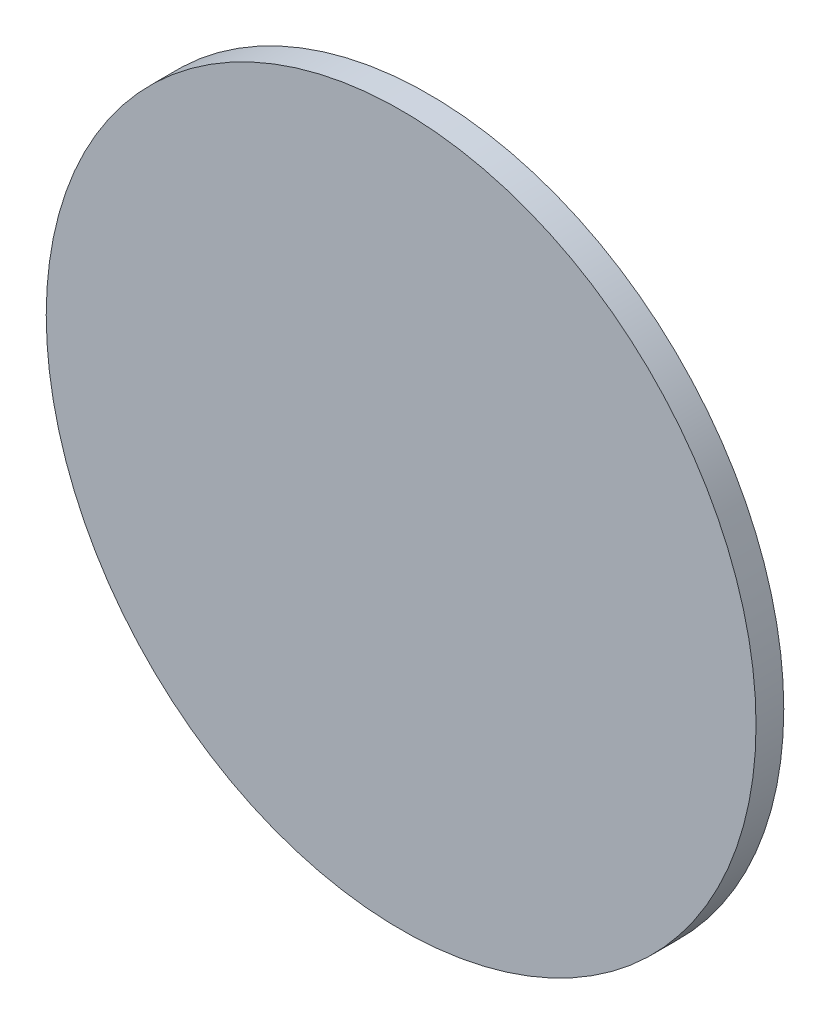
ISO-10303-21;
HEADER;
FILE_DESCRIPTION(('STEP AP214'),'2;1');
FILE_NAME('part.step','',(''),(''),'','','');
FILE_SCHEMA(('AUTOMOTIVE_DESIGN { 1 0 10303 214 1 1 1 1 }'));
ENDSEC;
DATA;
#1=APPLICATION_CONTEXT('core data for automotive mechanical design processes');
#2=APPLICATION_PROTOCOL_DEFINITION('international standard','automotive_design',2000,#1);
#3=PRODUCT_CONTEXT('',#1,'mechanical');
#4=PRODUCT('Part','Part','',(#3));
#5=PRODUCT_RELATED_PRODUCT_CATEGORY('part','',(#4));
#6=PRODUCT_DEFINITION_FORMATION('','',#4);
#7=PRODUCT_DEFINITION_CONTEXT('part definition',#1,'design');
#8=PRODUCT_DEFINITION('design','',#6,#7);
#9=PRODUCT_DEFINITION_SHAPE('','',#8);
#10=(LENGTH_UNIT() NAMED_UNIT(*) SI_UNIT(.MILLI.,.METRE.));
#11=(NAMED_UNIT(*) PLANE_ANGLE_UNIT() SI_UNIT($,.RADIAN.));
#12=(NAMED_UNIT(*) SI_UNIT($,.STERADIAN.) SOLID_ANGLE_UNIT());
#13=UNCERTAINTY_MEASURE_WITH_UNIT(LENGTH_MEASURE(1.E-05),#10,'distance_accuracy_value','');
#14=(GEOMETRIC_REPRESENTATION_CONTEXT(3) GLOBAL_UNCERTAINTY_ASSIGNED_CONTEXT((#13)) GLOBAL_UNIT_ASSIGNED_CONTEXT((#10,
#11,#12)) REPRESENTATION_CONTEXT('',''));
#15=CARTESIAN_POINT('',(0.,0.,0.));
#16=DIRECTION('',(0.,0.,1.));
#17=DIRECTION('',(1.,0.,0.));
#18=AXIS2_PLACEMENT_3D('',#15,#16,#17);
#19=CARTESIAN_POINT('',(0.,0.,10.));
#20=DIRECTION('',(0.,0.,-1.));
#21=DIRECTION('',(-1.,0.,0.));
#22=AXIS2_PLACEMENT_3D('',#19,#20,#21);
#23=CYLINDRICAL_SURFACE('',#22,128.);
#24=CARTESIAN_POINT('',(0.,0.,10.));
#25=DIRECTION('',(0.,0.,1.));
#26=DIRECTION('',(1.,0.,0.));
#27=AXIS2_PLACEMENT_3D('',#24,#25,#26);
#28=CIRCLE('',#27,128.);
#29=CARTESIAN_POINT('',(128.,0.,10.));
#30=VERTEX_POINT('',#29);
#31=EDGE_CURVE('E10',#30,#30,#28,.T.);
#32=ORIENTED_EDGE('',*,*,#31,.F.);
#33=EDGE_LOOP('',(#32));
#34=FACE_BOUND('',#33,.T.);
#35=CARTESIAN_POINT('',(0.,0.,0.));
#36=DIRECTION('',(0.,0.,1.));
#37=DIRECTION('',(1.,0.,0.));
#38=AXIS2_PLACEMENT_3D('',#35,#36,#37);
#39=CIRCLE('',#38,128.);
#40=CARTESIAN_POINT('',(128.,0.,0.));
#41=VERTEX_POINT('',#40);
#42=EDGE_CURVE('E35',#41,#41,#39,.T.);
#43=ORIENTED_EDGE('',*,*,#42,.T.);
#44=EDGE_LOOP('',(#43));
#45=FACE_BOUND('',#44,.T.);
#46=ADVANCED_FACE('F32',(#34,#45),#23,.T.);
#47=CARTESIAN_POINT('',(0.,0.,10.));
#48=DIRECTION('',(0.,0.,1.));
#49=DIRECTION('',(1.,0.,0.));
#50=AXIS2_PLACEMENT_3D('',#47,#48,#49);
#51=PLANE('',#50);
#52=ORIENTED_EDGE('',*,*,#31,.T.);
#53=EDGE_LOOP('',(#52));
#54=FACE_BOUND('',#53,.T.);
#55=ADVANCED_FACE('F47',(#54),#51,.T.);
#56=CARTESIAN_POINT('',(0.,0.,0.));
#57=DIRECTION('',(0.,0.,1.));
#58=DIRECTION('',(1.,0.,0.));
#59=AXIS2_PLACEMENT_3D('',#56,#57,#58);
#60=PLANE('',#59);
#61=ORIENTED_EDGE('',*,*,#42,.F.);
#62=EDGE_LOOP('',(#61));
#63=FACE_BOUND('',#62,.T.);
#64=ADVANCED_FACE('F45',(#63),#60,.F.);
#65=CLOSED_SHELL('',(#46,#55,#64));
#66=MANIFOLD_SOLID_BREP('B2',#65);
#67=ADVANCED_BREP_SHAPE_REPRESENTATION('',(#18,#66),#14);
#68=SHAPE_DEFINITION_REPRESENTATION(#9,#67);
ENDSEC;
END-ISO-10303-21;
